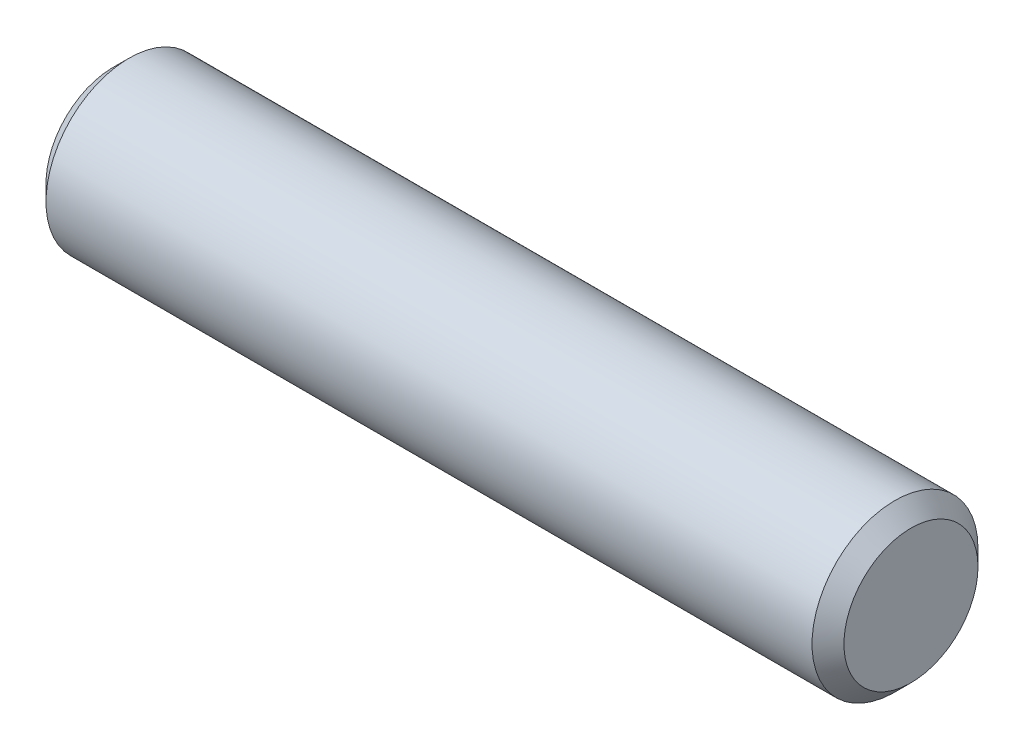
ISO-10303-21;
HEADER;
FILE_DESCRIPTION(('STEP AP214'),'2;1');
FILE_NAME('part.step','',(''),(''),'','','');
FILE_SCHEMA(('AUTOMOTIVE_DESIGN { 1 0 10303 214 1 1 1 1 }'));
ENDSEC;
DATA;
#1=APPLICATION_CONTEXT('core data for automotive mechanical design processes');
#2=APPLICATION_PROTOCOL_DEFINITION('international standard','automotive_design',2000,#1);
#3=PRODUCT_CONTEXT('',#1,'mechanical');
#4=PRODUCT('Part','Part','',(#3));
#5=PRODUCT_RELATED_PRODUCT_CATEGORY('part','',(#4));
#6=PRODUCT_DEFINITION_FORMATION('','',#4);
#7=PRODUCT_DEFINITION_CONTEXT('part definition',#1,'design');
#8=PRODUCT_DEFINITION('design','',#6,#7);
#9=PRODUCT_DEFINITION_SHAPE('','',#8);
#10=(LENGTH_UNIT() NAMED_UNIT(*) SI_UNIT(.MILLI.,.METRE.));
#11=(NAMED_UNIT(*) PLANE_ANGLE_UNIT() SI_UNIT($,.RADIAN.));
#12=(NAMED_UNIT(*) SI_UNIT($,.STERADIAN.) SOLID_ANGLE_UNIT());
#13=UNCERTAINTY_MEASURE_WITH_UNIT(LENGTH_MEASURE(1.E-05),#10,'distance_accuracy_value','');
#14=(GEOMETRIC_REPRESENTATION_CONTEXT(3) GLOBAL_UNCERTAINTY_ASSIGNED_CONTEXT((#13)) GLOBAL_UNIT_ASSIGNED_CONTEXT((#10,
#11,#12)) REPRESENTATION_CONTEXT('',''));
#15=CARTESIAN_POINT('',(0.,0.,0.));
#16=DIRECTION('',(0.,0.,1.));
#17=DIRECTION('',(1.,0.,0.));
#18=AXIS2_PLACEMENT_3D('',#15,#16,#17);
#19=CARTESIAN_POINT('',(38.1,0.,0.));
#20=DIRECTION('',(-1.,0.,0.));
#21=DIRECTION('',(0.,0.,1.));
#22=AXIS2_PLACEMENT_3D('',#19,#20,#21);
#23=CYLINDRICAL_SURFACE('',#22,7.9248);
#24=CARTESIAN_POINT('',(-36.5759999999999,0.,0.));
#25=DIRECTION('',(1.,0.,0.));
#26=DIRECTION('',(0.,0.,-1.));
#27=AXIS2_PLACEMENT_3D('',#24,#25,#26);
#28=CIRCLE('',#27,7.9248);
#29=CARTESIAN_POINT('',(-36.5759999999999,0.,-7.9248));
#30=VERTEX_POINT('',#29);
#31=EDGE_CURVE('E42',#30,#30,#28,.T.);
#32=ORIENTED_EDGE('',*,*,#31,.T.);
#33=EDGE_LOOP('',(#32));
#34=FACE_BOUND('',#33,.T.);
#35=CARTESIAN_POINT('',(36.576,0.,0.));
#36=DIRECTION('',(1.,0.,0.));
#37=DIRECTION('',(0.,0.,-1.));
#38=AXIS2_PLACEMENT_3D('',#35,#36,#37);
#39=CIRCLE('',#38,7.9248);
#40=CARTESIAN_POINT('',(36.576,0.,-7.9248));
#41=VERTEX_POINT('',#40);
#42=EDGE_CURVE('E46',#41,#41,#39,.F.);
#43=ORIENTED_EDGE('',*,*,#42,.T.);
#44=EDGE_LOOP('',(#43));
#45=FACE_BOUND('',#44,.T.);
#46=ADVANCED_FACE('F34',(#34,#45),#23,.T.);
#47=CARTESIAN_POINT('',(38.1,0.,0.));
#48=DIRECTION('',(1.,0.,0.));
#49=DIRECTION('',(0.,0.,-1.));
#50=AXIS2_PLACEMENT_3D('',#47,#48,#49);
#51=PLANE('',#50);
#52=CARTESIAN_POINT('',(38.1,0.,0.));
#53=DIRECTION('',(1.,0.,0.));
#54=DIRECTION('',(0.,0.,-1.));
#55=AXIS2_PLACEMENT_3D('',#52,#53,#54);
#56=CIRCLE('',#55,6.40080000000004);
#57=CARTESIAN_POINT('',(38.1,0.,-6.40080000000004));
#58=VERTEX_POINT('',#57);
#59=EDGE_CURVE('E50',#58,#58,#56,.T.);
#60=ORIENTED_EDGE('',*,*,#59,.T.);
#61=EDGE_LOOP('',(#60));
#62=FACE_BOUND('',#61,.T.);
#63=ADVANCED_FACE('F56',(#62),#51,.T.);
#64=CARTESIAN_POINT('',(-38.1,0.,0.));
#65=DIRECTION('',(1.,0.,0.));
#66=DIRECTION('',(0.,0.,-1.));
#67=AXIS2_PLACEMENT_3D('',#64,#65,#66);
#68=PLANE('',#67);
#69=CARTESIAN_POINT('',(-38.1,0.,0.));
#70=DIRECTION('',(1.,0.,0.));
#71=DIRECTION('',(0.,0.,-1.));
#72=AXIS2_PLACEMENT_3D('',#69,#70,#71);
#73=CIRCLE('',#72,6.40079999999993);
#74=CARTESIAN_POINT('',(-38.1,0.,-6.40079999999993));
#75=VERTEX_POINT('',#74);
#76=EDGE_CURVE('E10',#75,#75,#73,.F.);
#77=ORIENTED_EDGE('',*,*,#76,.T.);
#78=EDGE_LOOP('',(#77));
#79=FACE_BOUND('',#78,.T.);
#80=ADVANCED_FACE('F60',(#79),#68,.F.);
#81=CARTESIAN_POINT('',(38.1,0.,0.));
#82=DIRECTION('',(-1.,0.,0.));
#83=DIRECTION('',(0.,0.,1.));
#84=AXIS2_PLACEMENT_3D('',#81,#82,#83);
#85=CONICAL_SURFACE('',#84,6.40080000000004,0.785398163397446);
#86=ORIENTED_EDGE('',*,*,#42,.F.);
#87=EDGE_LOOP('',(#86));
#88=FACE_BOUND('',#87,.T.);
#89=ORIENTED_EDGE('',*,*,#59,.F.);
#90=EDGE_LOOP('',(#89));
#91=FACE_BOUND('',#90,.T.);
#92=ADVANCED_FACE('F58',(#88,#91),#85,.T.);
#93=CARTESIAN_POINT('',(-36.5759999999999,0.,0.));
#94=DIRECTION('',(1.,0.,0.));
#95=DIRECTION('',(0.,0.,-1.));
#96=AXIS2_PLACEMENT_3D('',#93,#94,#95);
#97=CONICAL_SURFACE('',#96,7.9248,0.785398163397448);
#98=ORIENTED_EDGE('',*,*,#76,.F.);
#99=EDGE_LOOP('',(#98));
#100=FACE_BOUND('',#99,.T.);
#101=ORIENTED_EDGE('',*,*,#31,.F.);
#102=EDGE_LOOP('',(#101));
#103=FACE_BOUND('',#102,.T.);
#104=ADVANCED_FACE('F37',(#100,#103),#97,.T.);
#105=CLOSED_SHELL('',(#46,#63,#80,#92,#104));
#106=MANIFOLD_SOLID_BREP('B2',#105);
#107=ADVANCED_BREP_SHAPE_REPRESENTATION('',(#18,#106),#14);
#108=SHAPE_DEFINITION_REPRESENTATION(#9,#107);
ENDSEC;
END-ISO-10303-21;
